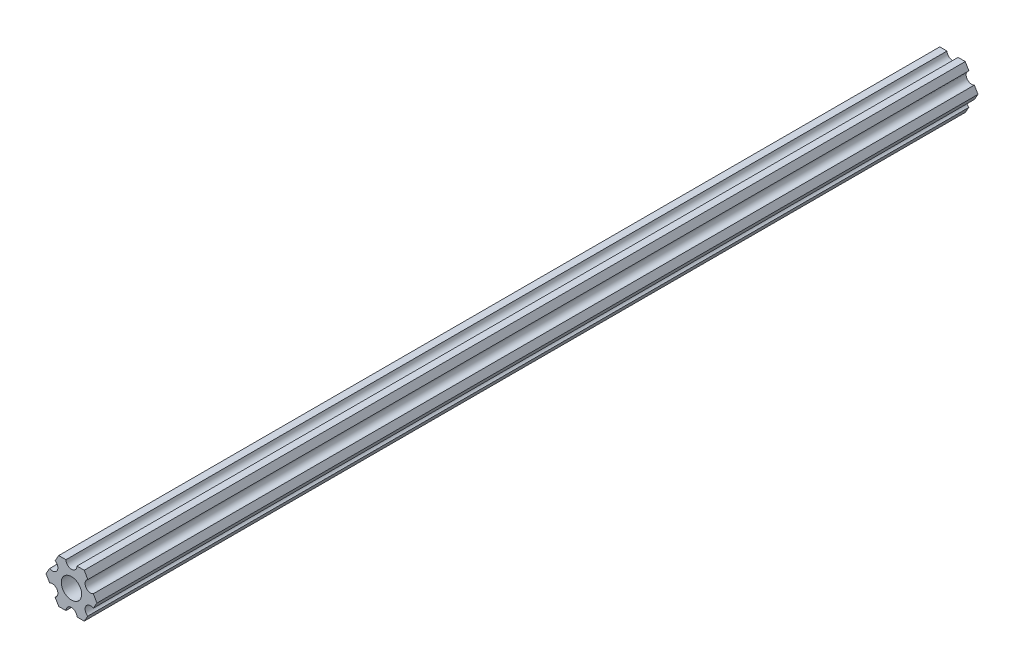
ISO-10303-21;
HEADER;
FILE_DESCRIPTION(('STEP AP214'),'2;1');
FILE_NAME('part.step','',(''),(''),'','','');
FILE_SCHEMA(('AUTOMOTIVE_DESIGN { 1 0 10303 214 1 1 1 1 }'));
ENDSEC;
DATA;
#1=APPLICATION_CONTEXT('core data for automotive mechanical design processes');
#2=APPLICATION_PROTOCOL_DEFINITION('international standard','automotive_design',2000,#1);
#3=PRODUCT_CONTEXT('',#1,'mechanical');
#4=PRODUCT('Part','Part','',(#3));
#5=PRODUCT_RELATED_PRODUCT_CATEGORY('part','',(#4));
#6=PRODUCT_DEFINITION_FORMATION('','',#4);
#7=PRODUCT_DEFINITION_CONTEXT('part definition',#1,'design');
#8=PRODUCT_DEFINITION('design','',#6,#7);
#9=PRODUCT_DEFINITION_SHAPE('','',#8);
#10=(LENGTH_UNIT() NAMED_UNIT(*) SI_UNIT(.MILLI.,.METRE.));
#11=(NAMED_UNIT(*) PLANE_ANGLE_UNIT() SI_UNIT($,.RADIAN.));
#12=(NAMED_UNIT(*) SI_UNIT($,.STERADIAN.) SOLID_ANGLE_UNIT());
#13=UNCERTAINTY_MEASURE_WITH_UNIT(LENGTH_MEASURE(1.E-05),#10,'distance_accuracy_value','');
#14=(GEOMETRIC_REPRESENTATION_CONTEXT(3) GLOBAL_UNCERTAINTY_ASSIGNED_CONTEXT((#13)) GLOBAL_UNIT_ASSIGNED_CONTEXT((#10,
#11,#12)) REPRESENTATION_CONTEXT('',''));
#15=CARTESIAN_POINT('',(0.,0.,0.));
#16=DIRECTION('',(0.,0.,1.));
#17=DIRECTION('',(1.,0.,0.));
#18=AXIS2_PLACEMENT_3D('',#15,#16,#17);
#19=CARTESIAN_POINT('',(5.49926123384919,-3.17500007340606,253.619));
#20=DIRECTION('',(0.,0.,-1.));
#21=DIRECTION('',(-1.,0.,0.));
#22=AXIS2_PLACEMENT_3D('',#19,#20,#21);
#23=CYLINDRICAL_SURFACE('',#22,1.58750000000001);
#24=CARTESIAN_POINT('',(5.49926123384919,-3.17500007340606,0.));
#25=DIRECTION('',(0.,0.,1.));
#26=DIRECTION('',(1.,0.,0.));
#27=AXIS2_PLACEMENT_3D('',#24,#25,#26);
#28=CIRCLE('',#27,1.58750000000001);
#29=CARTESIAN_POINT('',(6.29301118896201,-1.80018471898264,0.));
#30=VERTEX_POINT('',#29);
#31=CARTESIAN_POINT('',(4.70551127873637,-4.54981542782949,0.));
#32=VERTEX_POINT('',#31);
#33=EDGE_CURVE('E190',#30,#32,#28,.T.);
#34=ORIENTED_EDGE('',*,*,#33,.F.);
#35=DIRECTION('',(0.,0.,-1.));
#36=VECTOR('',#35,1.);
#37=CARTESIAN_POINT('',(6.29301118896201,-1.80018471898264,253.619));
#38=LINE('',#37,#36);
#39=CARTESIAN_POINT('',(6.29301118896201,-1.80018471898264,253.619));
#40=VERTEX_POINT('',#39);
#41=EDGE_CURVE('E11',#40,#30,#38,.T.);
#42=ORIENTED_EDGE('',*,*,#41,.F.);
#43=CARTESIAN_POINT('',(5.49926123384919,-3.17500007340606,253.619));
#44=DIRECTION('',(0.,0.,1.));
#45=DIRECTION('',(1.,0.,0.));
#46=AXIS2_PLACEMENT_3D('',#43,#44,#45);
#47=CIRCLE('',#46,1.58750000000001);
#48=CARTESIAN_POINT('',(4.70551127873637,-4.54981542782949,253.619));
#49=VERTEX_POINT('',#48);
#50=EDGE_CURVE('E241',#40,#49,#47,.T.);
#51=ORIENTED_EDGE('',*,*,#50,.T.);
#52=DIRECTION('',(0.,0.,-1.));
#53=VECTOR('',#52,1.);
#54=CARTESIAN_POINT('',(4.70551127873637,-4.54981542782949,253.619));
#55=LINE('',#54,#53);
#56=EDGE_CURVE('E36',#49,#32,#55,.T.);
#57=ORIENTED_EDGE('',*,*,#56,.T.);
#58=EDGE_LOOP('',(#34,#42,#51,#57));
#59=FACE_BOUND('',#58,.T.);
#60=ADVANCED_FACE('F33',(#59),#23,.F.);
#61=CARTESIAN_POINT('',(7.33234824269059,0.,253.619));
#62=DIRECTION('',(0.866025420109243,-0.499999971724609,0.));
#63=DIRECTION('',(0.499999971724609,0.866025420109243,0.));
#64=AXIS2_PLACEMENT_3D('',#61,#62,#63);
#65=PLANE('',#64);
#66=DIRECTION('',(-0.499999971724609,-0.866025420109243,0.));
#67=VECTOR('',#66,1.);
#68=CARTESIAN_POINT('',(7.33234824269059,0.,0.));
#69=LINE('',#68,#67);
#70=CARTESIAN_POINT('',(7.33234824269059,0.,0.));
#71=VERTEX_POINT('',#70);
#72=EDGE_CURVE('E239',#71,#30,#69,.T.);
#73=ORIENTED_EDGE('',*,*,#72,.F.);
#74=DIRECTION('',(0.,0.,-1.));
#75=VECTOR('',#74,1.);
#76=CARTESIAN_POINT('',(7.33234824269059,0.,253.619));
#77=LINE('',#76,#75);
#78=CARTESIAN_POINT('',(7.33234824269059,0.,253.619));
#79=VERTEX_POINT('',#78);
#80=EDGE_CURVE('E42',#79,#71,#77,.T.);
#81=ORIENTED_EDGE('',*,*,#80,.F.);
#82=DIRECTION('',(-0.499999971724609,-0.866025420109243,0.));
#83=VECTOR('',#82,1.);
#84=CARTESIAN_POINT('',(7.33234824269059,0.,253.619));
#85=LINE('',#84,#83);
#86=EDGE_CURVE('E180',#79,#40,#85,.T.);
#87=ORIENTED_EDGE('',*,*,#86,.T.);
#88=ORIENTED_EDGE('',*,*,#41,.T.);
#89=EDGE_LOOP('',(#73,#81,#87,#88));
#90=FACE_BOUND('',#89,.T.);
#91=ADVANCED_FACE('F273',(#90),#65,.T.);
#92=CARTESIAN_POINT('',(6.29301118896201,1.80018471898263,253.619));
#93=DIRECTION('',(0.866025420109242,0.49999997172461,0.));
#94=DIRECTION('',(-0.49999997172461,0.866025420109242,0.));
#95=AXIS2_PLACEMENT_3D('',#92,#93,#94);
#96=PLANE('',#95);
#97=DIRECTION('',(0.49999997172461,-0.866025420109242,0.));
#98=VECTOR('',#97,1.);
#99=CARTESIAN_POINT('',(6.29301118896201,1.80018471898263,0.));
#100=LINE('',#99,#98);
#101=CARTESIAN_POINT('',(6.29301118896201,1.80018471898263,0.));
#102=VERTEX_POINT('',#101);
#103=EDGE_CURVE('E167',#102,#71,#100,.T.);
#104=ORIENTED_EDGE('',*,*,#103,.F.);
#105=DIRECTION('',(0.,0.,-1.));
#106=VECTOR('',#105,1.);
#107=CARTESIAN_POINT('',(6.29301118896201,1.80018471898263,253.619));
#108=LINE('',#107,#106);
#109=CARTESIAN_POINT('',(6.29301118896201,1.80018471898263,253.619));
#110=VERTEX_POINT('',#109);
#111=EDGE_CURVE('E162',#110,#102,#108,.T.);
#112=ORIENTED_EDGE('',*,*,#111,.F.);
#113=DIRECTION('',(0.49999997172461,-0.866025420109242,0.));
#114=VECTOR('',#113,1.);
#115=CARTESIAN_POINT('',(6.29301118896201,1.80018471898263,253.619));
#116=LINE('',#115,#114);
#117=EDGE_CURVE('E165',#110,#79,#116,.T.);
#118=ORIENTED_EDGE('',*,*,#117,.T.);
#119=ORIENTED_EDGE('',*,*,#80,.T.);
#120=EDGE_LOOP('',(#104,#112,#118,#119));
#121=FACE_BOUND('',#120,.T.);
#122=ADVANCED_FACE('F164',(#121),#96,.T.);
#123=CARTESIAN_POINT('',(5.49926123384919,3.17500007340606,253.619));
#124=DIRECTION('',(0.,0.,-1.));
#125=DIRECTION('',(-1.,0.,0.));
#126=AXIS2_PLACEMENT_3D('',#123,#124,#125);
#127=CYLINDRICAL_SURFACE('',#126,1.5875);
#128=CARTESIAN_POINT('',(5.49926123384919,3.17500007340606,0.));
#129=DIRECTION('',(0.,0.,1.));
#130=DIRECTION('',(1.,0.,0.));
#131=AXIS2_PLACEMENT_3D('',#128,#129,#130);
#132=CIRCLE('',#131,1.5875);
#133=CARTESIAN_POINT('',(4.70551127873637,4.54981542782948,0.));
#134=VERTEX_POINT('',#133);
#135=EDGE_CURVE('E236',#134,#102,#132,.T.);
#136=ORIENTED_EDGE('',*,*,#135,.F.);
#137=DIRECTION('',(0.,0.,-1.));
#138=VECTOR('',#137,1.);
#139=CARTESIAN_POINT('',(4.70551127873637,4.54981542782948,253.619));
#140=LINE('',#139,#138);
#141=CARTESIAN_POINT('',(4.70551127873637,4.54981542782948,253.619));
#142=VERTEX_POINT('',#141);
#143=EDGE_CURVE('E172',#142,#134,#140,.T.);
#144=ORIENTED_EDGE('',*,*,#143,.F.);
#145=CARTESIAN_POINT('',(5.49926123384919,3.17500007340606,253.619));
#146=DIRECTION('',(0.,0.,1.));
#147=DIRECTION('',(1.,0.,0.));
#148=AXIS2_PLACEMENT_3D('',#145,#146,#147);
#149=CIRCLE('',#148,1.5875);
#150=EDGE_CURVE('E178',#142,#110,#149,.T.);
#151=ORIENTED_EDGE('',*,*,#150,.T.);
#152=ORIENTED_EDGE('',*,*,#111,.T.);
#153=EDGE_LOOP('',(#136,#144,#151,#152));
#154=FACE_BOUND('',#153,.T.);
#155=ADVANCED_FACE('F182',(#154),#127,.F.);
#156=CARTESIAN_POINT('',(3.6661742250078,6.35000014681211,253.619));
#157=DIRECTION('',(0.866025420109242,0.49999997172461,0.));
#158=DIRECTION('',(-0.49999997172461,0.866025420109242,0.));
#159=AXIS2_PLACEMENT_3D('',#156,#157,#158);
#160=PLANE('',#159);
#161=DIRECTION('',(0.49999997172461,-0.866025420109242,0.));
#162=VECTOR('',#161,1.);
#163=CARTESIAN_POINT('',(3.6661742250078,6.35000014681211,0.));
#164=LINE('',#163,#162);
#165=CARTESIAN_POINT('',(3.6661742250078,6.35000014681211,0.));
#166=VERTEX_POINT('',#165);
#167=EDGE_CURVE('E233',#166,#134,#164,.T.);
#168=ORIENTED_EDGE('',*,*,#167,.F.);
#169=DIRECTION('',(0.,0.,-1.));
#170=VECTOR('',#169,1.);
#171=CARTESIAN_POINT('',(3.6661742250078,6.35000014681211,253.619));
#172=LINE('',#171,#170);
#173=CARTESIAN_POINT('',(3.6661742250078,6.35000014681211,253.619));
#174=VERTEX_POINT('',#173);
#175=EDGE_CURVE('E245',#174,#166,#172,.T.);
#176=ORIENTED_EDGE('',*,*,#175,.F.);
#177=DIRECTION('',(0.49999997172461,-0.866025420109242,0.));
#178=VECTOR('',#177,1.);
#179=CARTESIAN_POINT('',(3.6661742250078,6.35000014681211,253.619));
#180=LINE('',#179,#178);
#181=EDGE_CURVE('E183',#174,#142,#180,.T.);
#182=ORIENTED_EDGE('',*,*,#181,.T.);
#183=ORIENTED_EDGE('',*,*,#143,.T.);
#184=EDGE_LOOP('',(#168,#176,#182,#183));
#185=FACE_BOUND('',#184,.T.);
#186=ADVANCED_FACE('F286',(#185),#160,.T.);
#187=CARTESIAN_POINT('',(1.5875,6.35000014681211,253.619));
#188=DIRECTION('',(0.,1.,0.));
#189=DIRECTION('',(0.,0.,1.));
#190=AXIS2_PLACEMENT_3D('',#187,#188,#189);
#191=PLANE('',#190);
#192=DIRECTION('',(1.,0.,0.));
#193=VECTOR('',#192,1.);
#194=CARTESIAN_POINT('',(1.5875,6.35000014681211,0.));
#195=LINE('',#194,#193);
#196=CARTESIAN_POINT('',(1.5875,6.35000014681211,0.));
#197=VERTEX_POINT('',#196);
#198=EDGE_CURVE('E230',#197,#166,#195,.T.);
#199=ORIENTED_EDGE('',*,*,#198,.F.);
#200=DIRECTION('',(0.,0.,-1.));
#201=VECTOR('',#200,1.);
#202=CARTESIAN_POINT('',(1.5875,6.35000014681211,253.619));
#203=LINE('',#202,#201);
#204=CARTESIAN_POINT('',(1.5875,6.35000014681211,253.619));
#205=VERTEX_POINT('',#204);
#206=EDGE_CURVE('E247',#205,#197,#203,.T.);
#207=ORIENTED_EDGE('',*,*,#206,.F.);
#208=DIRECTION('',(1.,0.,0.));
#209=VECTOR('',#208,1.);
#210=CARTESIAN_POINT('',(1.5875,6.35000014681211,253.619));
#211=LINE('',#210,#209);
#212=EDGE_CURVE('E185',#205,#174,#211,.T.);
#213=ORIENTED_EDGE('',*,*,#212,.T.);
#214=ORIENTED_EDGE('',*,*,#175,.T.);
#215=EDGE_LOOP('',(#199,#207,#213,#214));
#216=FACE_BOUND('',#215,.T.);
#217=ADVANCED_FACE('F289',(#216),#191,.T.);
#218=CARTESIAN_POINT('',(0.,6.35000014681211,253.619));
#219=DIRECTION('',(0.,0.,-1.));
#220=DIRECTION('',(-1.,0.,0.));
#221=AXIS2_PLACEMENT_3D('',#218,#219,#220);
#222=CYLINDRICAL_SURFACE('',#221,1.5875);
#223=CARTESIAN_POINT('',(0.,6.35000014681211,0.));
#224=DIRECTION('',(0.,0.,1.));
#225=DIRECTION('',(1.,0.,0.));
#226=AXIS2_PLACEMENT_3D('',#223,#224,#225);
#227=CIRCLE('',#226,1.5875);
#228=CARTESIAN_POINT('',(-1.5875,6.35000014681211,0.));
#229=VERTEX_POINT('',#228);
#230=EDGE_CURVE('E227',#229,#197,#227,.T.);
#231=ORIENTED_EDGE('',*,*,#230,.F.);
#232=DIRECTION('',(0.,0.,-1.));
#233=VECTOR('',#232,1.);
#234=CARTESIAN_POINT('',(-1.5875,6.35000014681211,253.619));
#235=LINE('',#234,#233);
#236=CARTESIAN_POINT('',(-1.5875,6.35000014681211,253.619));
#237=VERTEX_POINT('',#236);
#238=EDGE_CURVE('E249',#237,#229,#235,.T.);
#239=ORIENTED_EDGE('',*,*,#238,.F.);
#240=CARTESIAN_POINT('',(0.,6.35000014681211,253.619));
#241=DIRECTION('',(0.,0.,1.));
#242=DIRECTION('',(1.,0.,0.));
#243=AXIS2_PLACEMENT_3D('',#240,#241,#242);
#244=CIRCLE('',#243,1.5875);
#245=EDGE_CURVE('E394',#237,#205,#244,.T.);
#246=ORIENTED_EDGE('',*,*,#245,.T.);
#247=ORIENTED_EDGE('',*,*,#206,.T.);
#248=EDGE_LOOP('',(#231,#239,#246,#247));
#249=FACE_BOUND('',#248,.T.);
#250=ADVANCED_FACE('F293',(#249),#222,.F.);
#251=CARTESIAN_POINT('',(-3.6661742250078,6.35000014681211,253.619));
#252=DIRECTION('',(0.,1.,0.));
#253=DIRECTION('',(0.,0.,1.));
#254=AXIS2_PLACEMENT_3D('',#251,#252,#253);
#255=PLANE('',#254);
#256=DIRECTION('',(1.,0.,0.));
#257=VECTOR('',#256,1.);
#258=CARTESIAN_POINT('',(-3.6661742250078,6.35000014681211,0.));
#259=LINE('',#258,#257);
#260=CARTESIAN_POINT('',(-3.6661742250078,6.35000014681211,0.));
#261=VERTEX_POINT('',#260);
#262=EDGE_CURVE('E224',#261,#229,#259,.T.);
#263=ORIENTED_EDGE('',*,*,#262,.F.);
#264=DIRECTION('',(0.,0.,-1.));
#265=VECTOR('',#264,1.);
#266=CARTESIAN_POINT('',(-3.6661742250078,6.35000014681211,253.619));
#267=LINE('',#266,#265);
#268=CARTESIAN_POINT('',(-3.6661742250078,6.35000014681211,253.619));
#269=VERTEX_POINT('',#268);
#270=EDGE_CURVE('E251',#269,#261,#267,.T.);
#271=ORIENTED_EDGE('',*,*,#270,.F.);
#272=DIRECTION('',(1.,0.,0.));
#273=VECTOR('',#272,1.);
#274=CARTESIAN_POINT('',(-3.6661742250078,6.35000014681211,253.619));
#275=LINE('',#274,#273);
#276=EDGE_CURVE('E391',#269,#237,#275,.T.);
#277=ORIENTED_EDGE('',*,*,#276,.T.);
#278=ORIENTED_EDGE('',*,*,#238,.T.);
#279=EDGE_LOOP('',(#263,#271,#277,#278));
#280=FACE_BOUND('',#279,.T.);
#281=ADVANCED_FACE('F297',(#280),#255,.T.);
#282=CARTESIAN_POINT('',(-4.70551127873637,4.54981542782948,253.619));
#283=DIRECTION('',(-0.866025420109242,0.49999997172461,0.));
#284=DIRECTION('',(-0.49999997172461,-0.866025420109242,0.));
#285=AXIS2_PLACEMENT_3D('',#282,#283,#284);
#286=PLANE('',#285);
#287=DIRECTION('',(0.49999997172461,0.866025420109242,0.));
#288=VECTOR('',#287,1.);
#289=CARTESIAN_POINT('',(-4.70551127873637,4.54981542782948,0.));
#290=LINE('',#289,#288);
#291=CARTESIAN_POINT('',(-4.70551127873637,4.54981542782948,0.));
#292=VERTEX_POINT('',#291);
#293=EDGE_CURVE('E221',#292,#261,#290,.T.);
#294=ORIENTED_EDGE('',*,*,#293,.F.);
#295=DIRECTION('',(0.,0.,-1.));
#296=VECTOR('',#295,1.);
#297=CARTESIAN_POINT('',(-4.70551127873637,4.54981542782948,253.619));
#298=LINE('',#297,#296);
#299=CARTESIAN_POINT('',(-4.70551127873637,4.54981542782948,253.619));
#300=VERTEX_POINT('',#299);
#301=EDGE_CURVE('E253',#300,#292,#298,.T.);
#302=ORIENTED_EDGE('',*,*,#301,.F.);
#303=DIRECTION('',(0.49999997172461,0.866025420109242,0.));
#304=VECTOR('',#303,1.);
#305=CARTESIAN_POINT('',(-4.70551127873637,4.54981542782948,253.619));
#306=LINE('',#305,#304);
#307=EDGE_CURVE('E388',#300,#269,#306,.T.);
#308=ORIENTED_EDGE('',*,*,#307,.T.);
#309=ORIENTED_EDGE('',*,*,#270,.T.);
#310=EDGE_LOOP('',(#294,#302,#308,#309));
#311=FACE_BOUND('',#310,.T.);
#312=ADVANCED_FACE('F301',(#311),#286,.T.);
#313=CARTESIAN_POINT('',(-5.49926123384919,3.17500007340605,253.619));
#314=DIRECTION('',(0.,0.,-1.));
#315=DIRECTION('',(-1.,0.,0.));
#316=AXIS2_PLACEMENT_3D('',#313,#314,#315);
#317=CYLINDRICAL_SURFACE('',#316,1.5875);
#318=CARTESIAN_POINT('',(-5.49926123384919,3.17500007340605,0.));
#319=DIRECTION('',(0.,0.,1.));
#320=DIRECTION('',(1.,0.,0.));
#321=AXIS2_PLACEMENT_3D('',#318,#319,#320);
#322=CIRCLE('',#321,1.5875);
#323=CARTESIAN_POINT('',(-6.29301118896201,1.80018471898263,0.));
#324=VERTEX_POINT('',#323);
#325=EDGE_CURVE('E218',#324,#292,#322,.T.);
#326=ORIENTED_EDGE('',*,*,#325,.F.);
#327=DIRECTION('',(0.,0.,-1.));
#328=VECTOR('',#327,1.);
#329=CARTESIAN_POINT('',(-6.29301118896201,1.80018471898263,253.619));
#330=LINE('',#329,#328);
#331=CARTESIAN_POINT('',(-6.29301118896201,1.80018471898263,253.619));
#332=VERTEX_POINT('',#331);
#333=EDGE_CURVE('E255',#332,#324,#330,.T.);
#334=ORIENTED_EDGE('',*,*,#333,.F.);
#335=CARTESIAN_POINT('',(-5.49926123384919,3.17500007340605,253.619));
#336=DIRECTION('',(0.,0.,1.));
#337=DIRECTION('',(1.,0.,0.));
#338=AXIS2_PLACEMENT_3D('',#335,#336,#337);
#339=CIRCLE('',#338,1.5875);
#340=EDGE_CURVE('E385',#332,#300,#339,.T.);
#341=ORIENTED_EDGE('',*,*,#340,.T.);
#342=ORIENTED_EDGE('',*,*,#301,.T.);
#343=EDGE_LOOP('',(#326,#334,#341,#342));
#344=FACE_BOUND('',#343,.T.);
#345=ADVANCED_FACE('F305',(#344),#317,.F.);
#346=CARTESIAN_POINT('',(-7.33234824269059,0.,253.619));
#347=DIRECTION('',(-0.866025420109242,0.49999997172461,0.));
#348=DIRECTION('',(-0.49999997172461,-0.866025420109242,0.));
#349=AXIS2_PLACEMENT_3D('',#346,#347,#348);
#350=PLANE('',#349);
#351=DIRECTION('',(0.49999997172461,0.866025420109242,0.));
#352=VECTOR('',#351,1.);
#353=CARTESIAN_POINT('',(-7.33234824269059,0.,0.));
#354=LINE('',#353,#352);
#355=CARTESIAN_POINT('',(-7.33234824269059,0.,0.));
#356=VERTEX_POINT('',#355);
#357=EDGE_CURVE('E215',#356,#324,#354,.T.);
#358=ORIENTED_EDGE('',*,*,#357,.F.);
#359=DIRECTION('',(0.,0.,-1.));
#360=VECTOR('',#359,1.);
#361=CARTESIAN_POINT('',(-7.33234824269059,0.,253.619));
#362=LINE('',#361,#360);
#363=CARTESIAN_POINT('',(-7.33234824269059,0.,253.619));
#364=VERTEX_POINT('',#363);
#365=EDGE_CURVE('E257',#364,#356,#362,.T.);
#366=ORIENTED_EDGE('',*,*,#365,.F.);
#367=DIRECTION('',(0.49999997172461,0.866025420109242,0.));
#368=VECTOR('',#367,1.);
#369=CARTESIAN_POINT('',(-7.33234824269059,0.,253.619));
#370=LINE('',#369,#368);
#371=EDGE_CURVE('E382',#364,#332,#370,.T.);
#372=ORIENTED_EDGE('',*,*,#371,.T.);
#373=ORIENTED_EDGE('',*,*,#333,.T.);
#374=EDGE_LOOP('',(#358,#366,#372,#373));
#375=FACE_BOUND('',#374,.T.);
#376=ADVANCED_FACE('F309',(#375),#350,.T.);
#377=CARTESIAN_POINT('',(-6.29301118896201,-1.80018471898264,253.619));
#378=DIRECTION('',(-0.866025420109243,-0.499999971724609,0.));
#379=DIRECTION('',(0.499999971724609,-0.866025420109243,0.));
#380=AXIS2_PLACEMENT_3D('',#377,#378,#379);
#381=PLANE('',#380);
#382=DIRECTION('',(-0.499999971724609,0.866025420109243,0.));
#383=VECTOR('',#382,1.);
#384=CARTESIAN_POINT('',(-6.29301118896201,-1.80018471898264,0.));
#385=LINE('',#384,#383);
#386=CARTESIAN_POINT('',(-6.29301118896201,-1.80018471898264,0.));
#387=VERTEX_POINT('',#386);
#388=EDGE_CURVE('E212',#387,#356,#385,.T.);
#389=ORIENTED_EDGE('',*,*,#388,.F.);
#390=DIRECTION('',(0.,0.,-1.));
#391=VECTOR('',#390,1.);
#392=CARTESIAN_POINT('',(-6.29301118896201,-1.80018471898264,253.619));
#393=LINE('',#392,#391);
#394=CARTESIAN_POINT('',(-6.29301118896201,-1.80018471898264,253.619));
#395=VERTEX_POINT('',#394);
#396=EDGE_CURVE('E259',#395,#387,#393,.T.);
#397=ORIENTED_EDGE('',*,*,#396,.F.);
#398=DIRECTION('',(-0.499999971724609,0.866025420109243,0.));
#399=VECTOR('',#398,1.);
#400=CARTESIAN_POINT('',(-6.29301118896201,-1.80018471898264,253.619));
#401=LINE('',#400,#399);
#402=EDGE_CURVE('E379',#395,#364,#401,.T.);
#403=ORIENTED_EDGE('',*,*,#402,.T.);
#404=ORIENTED_EDGE('',*,*,#365,.T.);
#405=EDGE_LOOP('',(#389,#397,#403,#404));
#406=FACE_BOUND('',#405,.T.);
#407=ADVANCED_FACE('F313',(#406),#381,.T.);
#408=CARTESIAN_POINT('',(-5.49926123384919,-3.17500007340606,253.619));
#409=DIRECTION('',(0.,0.,-1.));
#410=DIRECTION('',(-1.,0.,0.));
#411=AXIS2_PLACEMENT_3D('',#408,#409,#410);
#412=CYLINDRICAL_SURFACE('',#411,1.58750000000001);
#413=CARTESIAN_POINT('',(-5.49926123384919,-3.17500007340606,0.));
#414=DIRECTION('',(0.,0.,1.));
#415=DIRECTION('',(1.,0.,0.));
#416=AXIS2_PLACEMENT_3D('',#413,#414,#415);
#417=CIRCLE('',#416,1.58750000000001);
#418=CARTESIAN_POINT('',(-4.70551127873637,-4.54981542782949,0.));
#419=VERTEX_POINT('',#418);
#420=EDGE_CURVE('E209',#419,#387,#417,.T.);
#421=ORIENTED_EDGE('',*,*,#420,.F.);
#422=DIRECTION('',(0.,0.,-1.));
#423=VECTOR('',#422,1.);
#424=CARTESIAN_POINT('',(-4.70551127873637,-4.54981542782949,253.619));
#425=LINE('',#424,#423);
#426=CARTESIAN_POINT('',(-4.70551127873637,-4.54981542782949,253.619));
#427=VERTEX_POINT('',#426);
#428=EDGE_CURVE('E261',#427,#419,#425,.T.);
#429=ORIENTED_EDGE('',*,*,#428,.F.);
#430=CARTESIAN_POINT('',(-5.49926123384919,-3.17500007340606,253.619));
#431=DIRECTION('',(0.,0.,1.));
#432=DIRECTION('',(1.,0.,0.));
#433=AXIS2_PLACEMENT_3D('',#430,#431,#432);
#434=CIRCLE('',#433,1.58750000000001);
#435=EDGE_CURVE('E376',#427,#395,#434,.T.);
#436=ORIENTED_EDGE('',*,*,#435,.T.);
#437=ORIENTED_EDGE('',*,*,#396,.T.);
#438=EDGE_LOOP('',(#421,#429,#436,#437));
#439=FACE_BOUND('',#438,.T.);
#440=ADVANCED_FACE('F317',(#439),#412,.F.);
#441=CARTESIAN_POINT('',(-3.6661742250078,-6.35000014681213,253.619));
#442=DIRECTION('',(-0.866025420109243,-0.499999971724609,0.));
#443=DIRECTION('',(0.499999971724609,-0.866025420109243,0.));
#444=AXIS2_PLACEMENT_3D('',#441,#442,#443);
#445=PLANE('',#444);
#446=DIRECTION('',(-0.499999971724609,0.866025420109243,0.));
#447=VECTOR('',#446,1.);
#448=CARTESIAN_POINT('',(-3.6661742250078,-6.35000014681213,0.));
#449=LINE('',#448,#447);
#450=CARTESIAN_POINT('',(-3.6661742250078,-6.35000014681213,0.));
#451=VERTEX_POINT('',#450);
#452=EDGE_CURVE('E206',#451,#419,#449,.T.);
#453=ORIENTED_EDGE('',*,*,#452,.F.);
#454=DIRECTION('',(0.,0.,-1.));
#455=VECTOR('',#454,1.);
#456=CARTESIAN_POINT('',(-3.6661742250078,-6.35000014681213,253.619));
#457=LINE('',#456,#455);
#458=CARTESIAN_POINT('',(-3.6661742250078,-6.35000014681213,253.619));
#459=VERTEX_POINT('',#458);
#460=EDGE_CURVE('E263',#459,#451,#457,.T.);
#461=ORIENTED_EDGE('',*,*,#460,.F.);
#462=DIRECTION('',(-0.499999971724609,0.866025420109243,0.));
#463=VECTOR('',#462,1.);
#464=CARTESIAN_POINT('',(-3.6661742250078,-6.35000014681213,253.619));
#465=LINE('',#464,#463);
#466=EDGE_CURVE('E373',#459,#427,#465,.T.);
#467=ORIENTED_EDGE('',*,*,#466,.T.);
#468=ORIENTED_EDGE('',*,*,#428,.T.);
#469=EDGE_LOOP('',(#453,#461,#467,#468));
#470=FACE_BOUND('',#469,.T.);
#471=ADVANCED_FACE('F321',(#470),#445,.T.);
#472=CARTESIAN_POINT('',(-1.5875,-6.35000014681213,253.619));
#473=DIRECTION('',(0.,-1.,0.));
#474=DIRECTION('',(0.,0.,-1.));
#475=AXIS2_PLACEMENT_3D('',#472,#473,#474);
#476=PLANE('',#475);
#477=DIRECTION('',(-1.,0.,0.));
#478=VECTOR('',#477,1.);
#479=CARTESIAN_POINT('',(-1.5875,-6.35000014681213,0.));
#480=LINE('',#479,#478);
#481=CARTESIAN_POINT('',(-1.5875,-6.35000014681213,0.));
#482=VERTEX_POINT('',#481);
#483=EDGE_CURVE('E203',#482,#451,#480,.T.);
#484=ORIENTED_EDGE('',*,*,#483,.F.);
#485=DIRECTION('',(0.,0.,-1.));
#486=VECTOR('',#485,1.);
#487=CARTESIAN_POINT('',(-1.5875,-6.35000014681213,253.619));
#488=LINE('',#487,#486);
#489=CARTESIAN_POINT('',(-1.5875,-6.35000014681213,253.619));
#490=VERTEX_POINT('',#489);
#491=EDGE_CURVE('E265',#490,#482,#488,.T.);
#492=ORIENTED_EDGE('',*,*,#491,.F.);
#493=DIRECTION('',(-1.,0.,0.));
#494=VECTOR('',#493,1.);
#495=CARTESIAN_POINT('',(-1.5875,-6.35000014681213,253.619));
#496=LINE('',#495,#494);
#497=EDGE_CURVE('E370',#490,#459,#496,.T.);
#498=ORIENTED_EDGE('',*,*,#497,.T.);
#499=ORIENTED_EDGE('',*,*,#460,.T.);
#500=EDGE_LOOP('',(#484,#492,#498,#499));
#501=FACE_BOUND('',#500,.T.);
#502=ADVANCED_FACE('F325',(#501),#476,.T.);
#503=CARTESIAN_POINT('',(0.,-6.35000014681213,253.619));
#504=DIRECTION('',(0.,0.,-1.));
#505=DIRECTION('',(-1.,0.,0.));
#506=AXIS2_PLACEMENT_3D('',#503,#504,#505);
#507=CYLINDRICAL_SURFACE('',#506,1.5875);
#508=CARTESIAN_POINT('',(0.,-6.35000014681213,0.));
#509=DIRECTION('',(0.,0.,1.));
#510=DIRECTION('',(1.,0.,0.));
#511=AXIS2_PLACEMENT_3D('',#508,#509,#510);
#512=CIRCLE('',#511,1.5875);
#513=CARTESIAN_POINT('',(1.5875,-6.35000014681213,0.));
#514=VERTEX_POINT('',#513);
#515=EDGE_CURVE('E200',#514,#482,#512,.T.);
#516=ORIENTED_EDGE('',*,*,#515,.F.);
#517=DIRECTION('',(0.,0.,-1.));
#518=VECTOR('',#517,1.);
#519=CARTESIAN_POINT('',(1.5875,-6.35000014681213,253.619));
#520=LINE('',#519,#518);
#521=CARTESIAN_POINT('',(1.5875,-6.35000014681213,253.619));
#522=VERTEX_POINT('',#521);
#523=EDGE_CURVE('E267',#522,#514,#520,.T.);
#524=ORIENTED_EDGE('',*,*,#523,.F.);
#525=CARTESIAN_POINT('',(0.,-6.35000014681213,253.619));
#526=DIRECTION('',(0.,0.,1.));
#527=DIRECTION('',(1.,0.,0.));
#528=AXIS2_PLACEMENT_3D('',#525,#526,#527);
#529=CIRCLE('',#528,1.5875);
#530=EDGE_CURVE('E367',#522,#490,#529,.T.);
#531=ORIENTED_EDGE('',*,*,#530,.T.);
#532=ORIENTED_EDGE('',*,*,#491,.T.);
#533=EDGE_LOOP('',(#516,#524,#531,#532));
#534=FACE_BOUND('',#533,.T.);
#535=ADVANCED_FACE('F329',(#534),#507,.F.);
#536=CARTESIAN_POINT('',(3.6661742250078,-6.35000014681213,253.619));
#537=DIRECTION('',(0.,-1.,0.));
#538=DIRECTION('',(0.,0.,-1.));
#539=AXIS2_PLACEMENT_3D('',#536,#537,#538);
#540=PLANE('',#539);
#541=DIRECTION('',(-1.,0.,0.));
#542=VECTOR('',#541,1.);
#543=CARTESIAN_POINT('',(3.6661742250078,-6.35000014681213,0.));
#544=LINE('',#543,#542);
#545=CARTESIAN_POINT('',(3.6661742250078,-6.35000014681213,0.));
#546=VERTEX_POINT('',#545);
#547=EDGE_CURVE('E197',#546,#514,#544,.T.);
#548=ORIENTED_EDGE('',*,*,#547,.F.);
#549=DIRECTION('',(0.,0.,-1.));
#550=VECTOR('',#549,1.);
#551=CARTESIAN_POINT('',(3.6661742250078,-6.35000014681213,253.619));
#552=LINE('',#551,#550);
#553=CARTESIAN_POINT('',(3.6661742250078,-6.35000014681213,253.619));
#554=VERTEX_POINT('',#553);
#555=EDGE_CURVE('E268',#554,#546,#552,.T.);
#556=ORIENTED_EDGE('',*,*,#555,.F.);
#557=DIRECTION('',(-1.,0.,0.));
#558=VECTOR('',#557,1.);
#559=CARTESIAN_POINT('',(3.6661742250078,-6.35000014681213,253.619));
#560=LINE('',#559,#558);
#561=EDGE_CURVE('E364',#554,#522,#560,.T.);
#562=ORIENTED_EDGE('',*,*,#561,.T.);
#563=ORIENTED_EDGE('',*,*,#523,.T.);
#564=EDGE_LOOP('',(#548,#556,#562,#563));
#565=FACE_BOUND('',#564,.T.);
#566=ADVANCED_FACE('F333',(#565),#540,.T.);
#567=CARTESIAN_POINT('',(4.70551127873637,-4.54981542782949,253.619));
#568=DIRECTION('',(0.866025420109243,-0.499999971724609,0.));
#569=DIRECTION('',(0.499999971724609,0.866025420109243,0.));
#570=AXIS2_PLACEMENT_3D('',#567,#568,#569);
#571=PLANE('',#570);
#572=DIRECTION('',(-0.499999971724609,-0.866025420109243,0.));
#573=VECTOR('',#572,1.);
#574=CARTESIAN_POINT('',(4.70551127873637,-4.54981542782949,0.));
#575=LINE('',#574,#573);
#576=EDGE_CURVE('E193',#32,#546,#575,.T.);
#577=ORIENTED_EDGE('',*,*,#576,.F.);
#578=ORIENTED_EDGE('',*,*,#56,.F.);
#579=DIRECTION('',(-0.499999971724609,-0.866025420109243,0.));
#580=VECTOR('',#579,1.);
#581=CARTESIAN_POINT('',(4.70551127873637,-4.54981542782949,253.619));
#582=LINE('',#581,#580);
#583=EDGE_CURVE('E362',#49,#554,#582,.T.);
#584=ORIENTED_EDGE('',*,*,#583,.T.);
#585=ORIENTED_EDGE('',*,*,#555,.T.);
#586=EDGE_LOOP('',(#577,#578,#584,#585));
#587=FACE_BOUND('',#586,.T.);
#588=ADVANCED_FACE('F270',(#587),#571,.T.);
#589=CARTESIAN_POINT('',(5.49926123384919,-3.17500007340606,253.619));
#590=DIRECTION('',(0.,0.,1.));
#591=DIRECTION('',(1.,0.,0.));
#592=AXIS2_PLACEMENT_3D('',#589,#590,#591);
#593=PLANE('',#592);
#594=CARTESIAN_POINT('',(0.,0.,253.619));
#595=DIRECTION('',(0.,0.,-1.));
#596=DIRECTION('',(1.,0.,0.));
#597=AXIS2_PLACEMENT_3D('',#594,#595,#596);
#598=CIRCLE('',#597,2.9337);
#599=CARTESIAN_POINT('',(2.9337,0.,253.619));
#600=VERTEX_POINT('',#599);
#601=EDGE_CURVE('E194',#600,#600,#598,.T.);
#602=ORIENTED_EDGE('',*,*,#601,.T.);
#603=EDGE_LOOP('',(#602));
#604=FACE_BOUND('',#603,.T.);
#605=ORIENTED_EDGE('',*,*,#50,.F.);
#606=ORIENTED_EDGE('',*,*,#86,.F.);
#607=ORIENTED_EDGE('',*,*,#117,.F.);
#608=ORIENTED_EDGE('',*,*,#150,.F.);
#609=ORIENTED_EDGE('',*,*,#181,.F.);
#610=ORIENTED_EDGE('',*,*,#212,.F.);
#611=ORIENTED_EDGE('',*,*,#245,.F.);
#612=ORIENTED_EDGE('',*,*,#276,.F.);
#613=ORIENTED_EDGE('',*,*,#307,.F.);
#614=ORIENTED_EDGE('',*,*,#340,.F.);
#615=ORIENTED_EDGE('',*,*,#371,.F.);
#616=ORIENTED_EDGE('',*,*,#402,.F.);
#617=ORIENTED_EDGE('',*,*,#435,.F.);
#618=ORIENTED_EDGE('',*,*,#466,.F.);
#619=ORIENTED_EDGE('',*,*,#497,.F.);
#620=ORIENTED_EDGE('',*,*,#530,.F.);
#621=ORIENTED_EDGE('',*,*,#561,.F.);
#622=ORIENTED_EDGE('',*,*,#583,.F.);
#623=EDGE_LOOP('',(#605,#606,#607,#608,#609,#610,#611,#612,#613,#614,#615,#616,#617,#618,#619,
#620,#621,#622));
#624=FACE_BOUND('',#623,.T.);
#625=ADVANCED_FACE('F176',(#604,#624),#593,.T.);
#626=CARTESIAN_POINT('',(5.49926123384919,-3.17500007340606,0.));
#627=DIRECTION('',(0.,0.,1.));
#628=DIRECTION('',(1.,0.,0.));
#629=AXIS2_PLACEMENT_3D('',#626,#627,#628);
#630=PLANE('',#629);
#631=CARTESIAN_POINT('',(0.,0.,0.));
#632=DIRECTION('',(0.,0.,-1.));
#633=DIRECTION('',(1.,0.,0.));
#634=AXIS2_PLACEMENT_3D('',#631,#632,#633);
#635=CIRCLE('',#634,2.9337);
#636=CARTESIAN_POINT('',(2.9337,0.,0.));
#637=VERTEX_POINT('',#636);
#638=EDGE_CURVE('E357',#637,#637,#635,.T.);
#639=ORIENTED_EDGE('',*,*,#638,.F.);
#640=EDGE_LOOP('',(#639));
#641=FACE_BOUND('',#640,.T.);
#642=ORIENTED_EDGE('',*,*,#33,.T.);
#643=ORIENTED_EDGE('',*,*,#576,.T.);
#644=ORIENTED_EDGE('',*,*,#547,.T.);
#645=ORIENTED_EDGE('',*,*,#515,.T.);
#646=ORIENTED_EDGE('',*,*,#483,.T.);
#647=ORIENTED_EDGE('',*,*,#452,.T.);
#648=ORIENTED_EDGE('',*,*,#420,.T.);
#649=ORIENTED_EDGE('',*,*,#388,.T.);
#650=ORIENTED_EDGE('',*,*,#357,.T.);
#651=ORIENTED_EDGE('',*,*,#325,.T.);
#652=ORIENTED_EDGE('',*,*,#293,.T.);
#653=ORIENTED_EDGE('',*,*,#262,.T.);
#654=ORIENTED_EDGE('',*,*,#230,.T.);
#655=ORIENTED_EDGE('',*,*,#198,.T.);
#656=ORIENTED_EDGE('',*,*,#167,.T.);
#657=ORIENTED_EDGE('',*,*,#135,.T.);
#658=ORIENTED_EDGE('',*,*,#103,.T.);
#659=ORIENTED_EDGE('',*,*,#72,.T.);
#660=EDGE_LOOP('',(#642,#643,#644,#645,#646,#647,#648,#649,#650,#651,#652,#653,#654,#655,#656,
#657,#658,#659));
#661=FACE_BOUND('',#660,.T.);
#662=ADVANCED_FACE('F272',(#641,#661),#630,.F.);
#663=CARTESIAN_POINT('',(0.,0.,253.619));
#664=DIRECTION('',(0.,0.,-1.));
#665=DIRECTION('',(-1.,0.,0.));
#666=AXIS2_PLACEMENT_3D('',#663,#664,#665);
#667=CYLINDRICAL_SURFACE('',#666,2.9337);
#668=ORIENTED_EDGE('',*,*,#601,.F.);
#669=EDGE_LOOP('',(#668));
#670=FACE_BOUND('',#669,.T.);
#671=ORIENTED_EDGE('',*,*,#638,.T.);
#672=EDGE_LOOP('',(#671));
#673=FACE_BOUND('',#672,.T.);
#674=ADVANCED_FACE('F345',(#670,#673),#667,.F.);
#675=CLOSED_SHELL('',(#60,#91,#122,#155,#186,#217,#250,#281,#312,#345,#376,#407,#440,#471,#502,
#535,#566,#588,#625,#662,#674));
#676=MANIFOLD_SOLID_BREP('B2',#675);
#677=ADVANCED_BREP_SHAPE_REPRESENTATION('',(#18,#676),#14);
#678=SHAPE_DEFINITION_REPRESENTATION(#9,#677);
ENDSEC;
END-ISO-10303-21;
